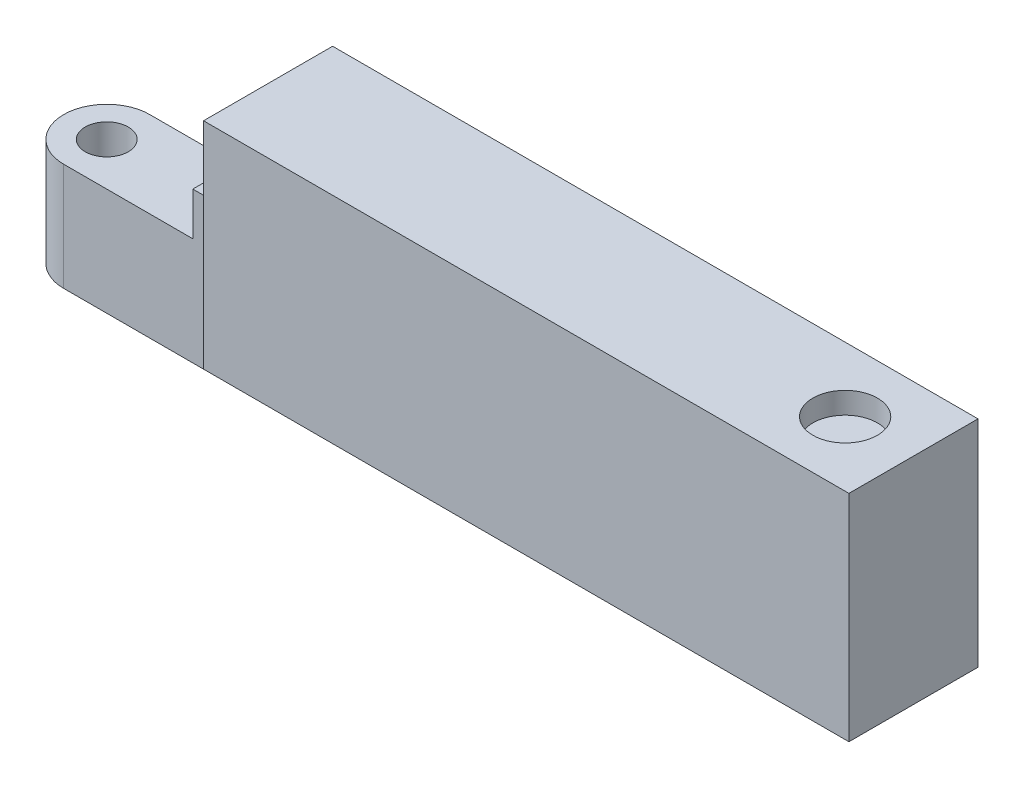
ISO-10303-21;
HEADER;
FILE_DESCRIPTION(('STEP AP214'),'2;1');
FILE_NAME('part.step','',(''),(''),'','','');
FILE_SCHEMA(('AUTOMOTIVE_DESIGN { 1 0 10303 214 1 1 1 1 }'));
ENDSEC;
DATA;
#1=APPLICATION_CONTEXT('core data for automotive mechanical design processes');
#2=APPLICATION_PROTOCOL_DEFINITION('international standard','automotive_design',2000,#1);
#3=PRODUCT_CONTEXT('',#1,'mechanical');
#4=PRODUCT('Part','Part','',(#3));
#5=PRODUCT_RELATED_PRODUCT_CATEGORY('part','',(#4));
#6=PRODUCT_DEFINITION_FORMATION('','',#4);
#7=PRODUCT_DEFINITION_CONTEXT('part definition',#1,'design');
#8=PRODUCT_DEFINITION('design','',#6,#7);
#9=PRODUCT_DEFINITION_SHAPE('','',#8);
#10=(LENGTH_UNIT() NAMED_UNIT(*) SI_UNIT(.MILLI.,.METRE.));
#11=(NAMED_UNIT(*) PLANE_ANGLE_UNIT() SI_UNIT($,.RADIAN.));
#12=(NAMED_UNIT(*) SI_UNIT($,.STERADIAN.) SOLID_ANGLE_UNIT());
#13=UNCERTAINTY_MEASURE_WITH_UNIT(LENGTH_MEASURE(1.E-05),#10,'distance_accuracy_value','');
#14=(GEOMETRIC_REPRESENTATION_CONTEXT(3) GLOBAL_UNCERTAINTY_ASSIGNED_CONTEXT((#13)) GLOBAL_UNIT_ASSIGNED_CONTEXT((#10,
#11,#12)) REPRESENTATION_CONTEXT('',''));
#15=CARTESIAN_POINT('',(0.,0.,0.));
#16=DIRECTION('',(0.,0.,1.));
#17=DIRECTION('',(1.,0.,0.));
#18=AXIS2_PLACEMENT_3D('',#15,#16,#17);
#19=CARTESIAN_POINT('',(-75.,-110.,-30.));
#20=DIRECTION('',(0.,-1.,0.));
#21=DIRECTION('',(1.,0.,0.));
#22=AXIS2_PLACEMENT_3D('',#19,#20,#21);
#23=CYLINDRICAL_SURFACE('',#22,20.);
#24=DIRECTION('',(0.,1.,0.));
#25=VECTOR('',#24,1.);
#26=CARTESIAN_POINT('',(-75.,-110.,-50.));
#27=LINE('',#26,#25);
#28=CARTESIAN_POINT('',(-75.,-110.,-50.));
#29=VERTEX_POINT('',#28);
#30=CARTESIAN_POINT('',(-75.,-60.,-50.));
#31=VERTEX_POINT('',#30);
#32=EDGE_CURVE('E232',#29,#31,#27,.T.);
#33=ORIENTED_EDGE('',*,*,#32,.F.);
#34=CARTESIAN_POINT('',(-75.,-110.,-30.));
#35=DIRECTION('',(0.,1.,0.));
#36=DIRECTION('',(-1.,0.,0.));
#37=AXIS2_PLACEMENT_3D('',#34,#35,#36);
#38=CIRCLE('',#37,20.);
#39=CARTESIAN_POINT('',(-75.,-110.,-9.99999999999999));
#40=VERTEX_POINT('',#39);
#41=EDGE_CURVE('E51',#40,#29,#38,.F.);
#42=ORIENTED_EDGE('',*,*,#41,.F.);
#43=DIRECTION('',(0.,1.,0.));
#44=VECTOR('',#43,1.);
#45=CARTESIAN_POINT('',(-75.,-110.,-9.99999999999999));
#46=LINE('',#45,#44);
#47=CARTESIAN_POINT('',(-75.,-60.,-10.));
#48=VERTEX_POINT('',#47);
#49=EDGE_CURVE('E236',#48,#40,#46,.F.);
#50=ORIENTED_EDGE('',*,*,#49,.F.);
#51=CARTESIAN_POINT('',(-75.,-60.,-30.));
#52=DIRECTION('',(0.,-1.,0.));
#53=DIRECTION('',(0.,0.,-1.));
#54=AXIS2_PLACEMENT_3D('',#51,#52,#53);
#55=CIRCLE('',#54,20.);
#56=EDGE_CURVE('E11',#31,#48,#55,.F.);
#57=ORIENTED_EDGE('',*,*,#56,.F.);
#58=EDGE_LOOP('',(#33,#42,#50,#57));
#59=FACE_BOUND('',#58,.T.);
#60=ADVANCED_FACE('F42',(#59),#23,.T.);
#61=CARTESIAN_POINT('',(0.,0.,-60.));
#62=DIRECTION('',(-1.,0.,0.));
#63=DIRECTION('',(0.,-1.,0.));
#64=AXIS2_PLACEMENT_3D('',#61,#62,#63);
#65=PLANE('',#64);
#66=DIRECTION('',(0.,-1.,0.));
#67=VECTOR('',#66,1.);
#68=CARTESIAN_POINT('',(0.,-40.,-50.));
#69=LINE('',#68,#67);
#70=CARTESIAN_POINT('',(0.,-40.,-50.));
#71=VERTEX_POINT('',#70);
#72=CARTESIAN_POINT('',(0.,-100.,-50.));
#73=VERTEX_POINT('',#72);
#74=EDGE_CURVE('E159',#71,#73,#69,.T.);
#75=ORIENTED_EDGE('',*,*,#74,.F.);
#76=DIRECTION('',(0.,0.,-1.));
#77=VECTOR('',#76,1.);
#78=CARTESIAN_POINT('',(0.,-40.,-50.));
#79=LINE('',#78,#77);
#80=CARTESIAN_POINT('',(0.,-40.,-10.));
#81=VERTEX_POINT('',#80);
#82=EDGE_CURVE('E171',#81,#71,#79,.T.);
#83=ORIENTED_EDGE('',*,*,#82,.F.);
#84=DIRECTION('',(0.,1.,0.));
#85=VECTOR('',#84,1.);
#86=CARTESIAN_POINT('',(0.,-40.,-10.));
#87=LINE('',#86,#85);
#88=CARTESIAN_POINT('',(0.,-100.,-9.99999999999999));
#89=VERTEX_POINT('',#88);
#90=EDGE_CURVE('E172',#89,#81,#87,.T.);
#91=ORIENTED_EDGE('',*,*,#90,.F.);
#92=DIRECTION('',(0.,0.,1.));
#93=VECTOR('',#92,1.);
#94=CARTESIAN_POINT('',(0.,-100.,-60.));
#95=LINE('',#94,#93);
#96=CARTESIAN_POINT('',(0.,-100.,0.));
#97=VERTEX_POINT('',#96);
#98=EDGE_CURVE('E203',#89,#97,#95,.T.);
#99=ORIENTED_EDGE('',*,*,#98,.T.);
#100=DIRECTION('',(0.,-1.,0.));
#101=VECTOR('',#100,1.);
#102=CARTESIAN_POINT('',(0.,0.,0.));
#103=LINE('',#102,#101);
#104=CARTESIAN_POINT('',(0.,0.,0.));
#105=VERTEX_POINT('',#104);
#106=EDGE_CURVE('E185',#105,#97,#103,.T.);
#107=ORIENTED_EDGE('',*,*,#106,.F.);
#108=DIRECTION('',(0.,0.,1.));
#109=VECTOR('',#108,1.);
#110=CARTESIAN_POINT('',(0.,0.,-60.));
#111=LINE('',#110,#109);
#112=CARTESIAN_POINT('',(0.,0.,-60.));
#113=VERTEX_POINT('',#112);
#114=EDGE_CURVE('E218',#113,#105,#111,.T.);
#115=ORIENTED_EDGE('',*,*,#114,.F.);
#116=DIRECTION('',(0.,-1.,0.));
#117=VECTOR('',#116,1.);
#118=CARTESIAN_POINT('',(0.,0.,-60.));
#119=LINE('',#118,#117);
#120=CARTESIAN_POINT('',(0.,-100.,-60.));
#121=VERTEX_POINT('',#120);
#122=EDGE_CURVE('E186',#113,#121,#119,.T.);
#123=ORIENTED_EDGE('',*,*,#122,.T.);
#124=EDGE_CURVE('E227',#121,#73,#95,.T.);
#125=ORIENTED_EDGE('',*,*,#124,.T.);
#126=EDGE_LOOP('',(#75,#83,#91,#99,#107,#115,#123,#125));
#127=FACE_BOUND('',#126,.T.);
#128=ADVANCED_FACE('F282',(#127),#65,.T.);
#129=CARTESIAN_POINT('',(0.,0.,-60.));
#130=DIRECTION('',(0.,1.,0.));
#131=DIRECTION('',(0.,0.,1.));
#132=AXIS2_PLACEMENT_3D('',#129,#130,#131);
#133=PLANE('',#132);
#134=CARTESIAN_POINT('',(268.245164070437,0.,-30.));
#135=DIRECTION('',(0.,1.,0.));
#136=DIRECTION('',(0.,0.,1.));
#137=AXIS2_PLACEMENT_3D('',#134,#135,#136);
#138=CIRCLE('',#137,15.);
#139=CARTESIAN_POINT('',(268.245164070437,0.,-15.));
#140=VERTEX_POINT('',#139);
#141=EDGE_CURVE('E269',#140,#140,#138,.T.);
#142=ORIENTED_EDGE('',*,*,#141,.F.);
#143=EDGE_LOOP('',(#142));
#144=FACE_BOUND('',#143,.T.);
#145=DIRECTION('',(-1.,0.,0.));
#146=VECTOR('',#145,1.);
#147=CARTESIAN_POINT('',(0.,0.,0.));
#148=LINE('',#147,#146);
#149=CARTESIAN_POINT('',(300.,0.,0.));
#150=VERTEX_POINT('',#149);
#151=EDGE_CURVE('E191',#150,#105,#148,.T.);
#152=ORIENTED_EDGE('',*,*,#151,.F.);
#153=DIRECTION('',(0.,0.,1.));
#154=VECTOR('',#153,1.);
#155=CARTESIAN_POINT('',(300.,0.,-60.));
#156=LINE('',#155,#154);
#157=CARTESIAN_POINT('',(300.,0.,-60.));
#158=VERTEX_POINT('',#157);
#159=EDGE_CURVE('E221',#158,#150,#156,.T.);
#160=ORIENTED_EDGE('',*,*,#159,.F.);
#161=DIRECTION('',(-1.,0.,0.));
#162=VECTOR('',#161,1.);
#163=CARTESIAN_POINT('',(0.,0.,-60.));
#164=LINE('',#163,#162);
#165=EDGE_CURVE('E199',#158,#113,#164,.T.);
#166=ORIENTED_EDGE('',*,*,#165,.T.);
#167=ORIENTED_EDGE('',*,*,#114,.T.);
#168=EDGE_LOOP('',(#152,#160,#166,#167));
#169=FACE_BOUND('',#168,.T.);
#170=ADVANCED_FACE('F278',(#144,#169),#133,.T.);
#171=CARTESIAN_POINT('',(300.,0.,-60.));
#172=DIRECTION('',(1.,0.,0.));
#173=DIRECTION('',(0.,0.,-1.));
#174=AXIS2_PLACEMENT_3D('',#171,#172,#173);
#175=PLANE('',#174);
#176=DIRECTION('',(0.,1.,0.));
#177=VECTOR('',#176,1.);
#178=CARTESIAN_POINT('',(300.,0.,0.));
#179=LINE('',#178,#177);
#180=CARTESIAN_POINT('',(300.,-100.,0.));
#181=VERTEX_POINT('',#180);
#182=EDGE_CURVE('E211',#181,#150,#179,.T.);
#183=ORIENTED_EDGE('',*,*,#182,.F.);
#184=DIRECTION('',(0.,0.,1.));
#185=VECTOR('',#184,1.);
#186=CARTESIAN_POINT('',(300.,-100.,-60.));
#187=LINE('',#186,#185);
#188=CARTESIAN_POINT('',(300.,-100.,-60.));
#189=VERTEX_POINT('',#188);
#190=EDGE_CURVE('E224',#189,#181,#187,.T.);
#191=ORIENTED_EDGE('',*,*,#190,.F.);
#192=DIRECTION('',(0.,1.,0.));
#193=VECTOR('',#192,1.);
#194=CARTESIAN_POINT('',(300.,0.,-60.));
#195=LINE('',#194,#193);
#196=EDGE_CURVE('E195',#189,#158,#195,.T.);
#197=ORIENTED_EDGE('',*,*,#196,.T.);
#198=ORIENTED_EDGE('',*,*,#159,.T.);
#199=EDGE_LOOP('',(#183,#191,#197,#198));
#200=FACE_BOUND('',#199,.T.);
#201=ADVANCED_FACE('F281',(#200),#175,.T.);
#202=CARTESIAN_POINT('',(0.,-100.,-60.));
#203=DIRECTION('',(0.,-1.,0.));
#204=DIRECTION('',(0.,0.,-1.));
#205=AXIS2_PLACEMENT_3D('',#202,#203,#204);
#206=PLANE('',#205);
#207=DIRECTION('',(1.,0.,0.));
#208=VECTOR('',#207,1.);
#209=CARTESIAN_POINT('',(0.,-100.,0.));
#210=LINE('',#209,#208);
#211=EDGE_CURVE('E207',#97,#181,#210,.T.);
#212=ORIENTED_EDGE('',*,*,#211,.F.);
#213=ORIENTED_EDGE('',*,*,#98,.F.);
#214=EDGE_CURVE('E231',#73,#89,#95,.T.);
#215=ORIENTED_EDGE('',*,*,#214,.F.);
#216=ORIENTED_EDGE('',*,*,#124,.F.);
#217=DIRECTION('',(1.,0.,0.));
#218=VECTOR('',#217,1.);
#219=CARTESIAN_POINT('',(0.,-100.,-60.));
#220=LINE('',#219,#218);
#221=EDGE_CURVE('E190',#121,#189,#220,.T.);
#222=ORIENTED_EDGE('',*,*,#221,.T.);
#223=ORIENTED_EDGE('',*,*,#190,.T.);
#224=EDGE_LOOP('',(#212,#213,#215,#216,#222,#223));
#225=FACE_BOUND('',#224,.T.);
#226=ADVANCED_FACE('F299',(#225),#206,.T.);
#227=CARTESIAN_POINT('',(0.,0.,-60.));
#228=DIRECTION('',(0.,0.,1.));
#229=DIRECTION('',(1.,0.,0.));
#230=AXIS2_PLACEMENT_3D('',#227,#228,#229);
#231=PLANE('',#230);
#232=ORIENTED_EDGE('',*,*,#122,.F.);
#233=ORIENTED_EDGE('',*,*,#165,.F.);
#234=ORIENTED_EDGE('',*,*,#196,.F.);
#235=ORIENTED_EDGE('',*,*,#221,.F.);
#236=EDGE_LOOP('',(#232,#233,#234,#235));
#237=FACE_BOUND('',#236,.T.);
#238=ADVANCED_FACE('F296',(#237),#231,.F.);
#239=CARTESIAN_POINT('',(0.,0.,0.));
#240=DIRECTION('',(0.,0.,1.));
#241=DIRECTION('',(1.,0.,0.));
#242=AXIS2_PLACEMENT_3D('',#239,#240,#241);
#243=PLANE('',#242);
#244=ORIENTED_EDGE('',*,*,#106,.T.);
#245=ORIENTED_EDGE('',*,*,#211,.T.);
#246=ORIENTED_EDGE('',*,*,#182,.T.);
#247=ORIENTED_EDGE('',*,*,#151,.T.);
#248=EDGE_LOOP('',(#244,#245,#246,#247));
#249=FACE_BOUND('',#248,.T.);
#250=ADVANCED_FACE('F287',(#249),#243,.T.);
#251=CARTESIAN_POINT('',(0.,0.,0.));
#252=DIRECTION('',(-1.,0.,0.));
#253=DIRECTION('',(0.,-1.,0.));
#254=AXIS2_PLACEMENT_3D('',#251,#252,#253);
#255=PLANE('',#254);
#256=CARTESIAN_POINT('',(0.,-110.,-50.));
#257=VERTEX_POINT('',#256);
#258=EDGE_CURVE('E158',#73,#257,#69,.T.);
#259=ORIENTED_EDGE('',*,*,#258,.F.);
#260=ORIENTED_EDGE('',*,*,#214,.T.);
#261=CARTESIAN_POINT('',(0.,-110.,-9.99999999999999));
#262=VERTEX_POINT('',#261);
#263=EDGE_CURVE('E167',#262,#89,#87,.T.);
#264=ORIENTED_EDGE('',*,*,#263,.F.);
#265=DIRECTION('',(0.,0.,1.));
#266=VECTOR('',#265,1.);
#267=CARTESIAN_POINT('',(0.,-110.,-50.));
#268=LINE('',#267,#266);
#269=EDGE_CURVE('E163',#257,#262,#268,.T.);
#270=ORIENTED_EDGE('',*,*,#269,.F.);
#271=EDGE_LOOP('',(#259,#260,#264,#270));
#272=FACE_BOUND('',#271,.T.);
#273=ADVANCED_FACE('F253',(#272),#255,.F.);
#274=CARTESIAN_POINT('',(-95.,-40.,-50.));
#275=DIRECTION('',(0.,0.,1.));
#276=DIRECTION('',(0.,-1.,0.));
#277=AXIS2_PLACEMENT_3D('',#274,#275,#276);
#278=PLANE('',#277);
#279=DIRECTION('',(1.,0.,0.));
#280=VECTOR('',#279,1.);
#281=CARTESIAN_POINT('',(-95.,-110.,-50.));
#282=LINE('',#281,#280);
#283=EDGE_CURVE('E182',#29,#257,#282,.T.);
#284=ORIENTED_EDGE('',*,*,#283,.F.);
#285=ORIENTED_EDGE('',*,*,#32,.T.);
#286=DIRECTION('',(1.,0.,0.));
#287=VECTOR('',#286,1.);
#288=CARTESIAN_POINT('',(-95.,-60.,-50.));
#289=LINE('',#288,#287);
#290=CARTESIAN_POINT('',(-15.,-60.,-50.));
#291=VERTEX_POINT('',#290);
#292=EDGE_CURVE('E152',#31,#291,#289,.T.);
#293=ORIENTED_EDGE('',*,*,#292,.T.);
#294=DIRECTION('',(0.,1.,0.));
#295=VECTOR('',#294,1.);
#296=CARTESIAN_POINT('',(-15.,-40.,-50.));
#297=LINE('',#296,#295);
#298=CARTESIAN_POINT('',(-15.,-40.,-50.));
#299=VERTEX_POINT('',#298);
#300=EDGE_CURVE('E137',#291,#299,#297,.T.);
#301=ORIENTED_EDGE('',*,*,#300,.T.);
#302=DIRECTION('',(1.,0.,0.));
#303=VECTOR('',#302,1.);
#304=CARTESIAN_POINT('',(-95.,-40.,-50.));
#305=LINE('',#304,#303);
#306=EDGE_CURVE('E175',#299,#71,#305,.T.);
#307=ORIENTED_EDGE('',*,*,#306,.T.);
#308=ORIENTED_EDGE('',*,*,#74,.T.);
#309=ORIENTED_EDGE('',*,*,#258,.T.);
#310=EDGE_LOOP('',(#284,#285,#293,#301,#307,#308,#309));
#311=FACE_BOUND('',#310,.T.);
#312=ADVANCED_FACE('F245',(#311),#278,.F.);
#313=CARTESIAN_POINT('',(-95.,-110.,-50.));
#314=DIRECTION('',(0.,1.,0.));
#315=DIRECTION('',(-1.,0.,0.));
#316=AXIS2_PLACEMENT_3D('',#313,#314,#315);
#317=PLANE('',#316);
#318=CARTESIAN_POINT('',(-75.,-110.,-30.));
#319=DIRECTION('',(0.,1.,0.));
#320=DIRECTION('',(0.,0.,1.));
#321=AXIS2_PLACEMENT_3D('',#318,#319,#320);
#322=CIRCLE('',#321,9.99999999999999);
#323=CARTESIAN_POINT('',(-75.,-110.,-20.));
#324=VERTEX_POINT('',#323);
#325=EDGE_CURVE('E130',#324,#324,#322,.T.);
#326=ORIENTED_EDGE('',*,*,#325,.T.);
#327=EDGE_LOOP('',(#326));
#328=FACE_BOUND('',#327,.T.);
#329=DIRECTION('',(1.,0.,0.));
#330=VECTOR('',#329,1.);
#331=CARTESIAN_POINT('',(-95.,-110.,-9.99999999999999));
#332=LINE('',#331,#330);
#333=EDGE_CURVE('E179',#40,#262,#332,.T.);
#334=ORIENTED_EDGE('',*,*,#333,.F.);
#335=ORIENTED_EDGE('',*,*,#41,.T.);
#336=ORIENTED_EDGE('',*,*,#283,.T.);
#337=ORIENTED_EDGE('',*,*,#269,.T.);
#338=EDGE_LOOP('',(#334,#335,#336,#337));
#339=FACE_BOUND('',#338,.T.);
#340=ADVANCED_FACE('F241',(#328,#339),#317,.F.);
#341=CARTESIAN_POINT('',(-95.,-40.,-10.));
#342=DIRECTION('',(0.,0.,-1.));
#343=DIRECTION('',(0.,1.,0.));
#344=AXIS2_PLACEMENT_3D('',#341,#342,#343);
#345=PLANE('',#344);
#346=DIRECTION('',(1.,0.,0.));
#347=VECTOR('',#346,1.);
#348=CARTESIAN_POINT('',(-95.,-60.,-10.));
#349=LINE('',#348,#347);
#350=CARTESIAN_POINT('',(-15.,-60.,-10.));
#351=VERTEX_POINT('',#350);
#352=EDGE_CURVE('E122',#48,#351,#349,.T.);
#353=ORIENTED_EDGE('',*,*,#352,.F.);
#354=ORIENTED_EDGE('',*,*,#49,.T.);
#355=ORIENTED_EDGE('',*,*,#333,.T.);
#356=ORIENTED_EDGE('',*,*,#263,.T.);
#357=ORIENTED_EDGE('',*,*,#90,.T.);
#358=DIRECTION('',(1.,0.,0.));
#359=VECTOR('',#358,1.);
#360=CARTESIAN_POINT('',(-95.,-40.,-10.));
#361=LINE('',#360,#359);
#362=CARTESIAN_POINT('',(-15.,-40.,-10.));
#363=VERTEX_POINT('',#362);
#364=EDGE_CURVE('E144',#363,#81,#361,.T.);
#365=ORIENTED_EDGE('',*,*,#364,.F.);
#366=DIRECTION('',(0.,1.,0.));
#367=VECTOR('',#366,1.);
#368=CARTESIAN_POINT('',(-15.,-40.,-10.));
#369=LINE('',#368,#367);
#370=EDGE_CURVE('E129',#351,#363,#369,.T.);
#371=ORIENTED_EDGE('',*,*,#370,.F.);
#372=EDGE_LOOP('',(#353,#354,#355,#356,#357,#365,#371));
#373=FACE_BOUND('',#372,.T.);
#374=ADVANCED_FACE('F142',(#373),#345,.F.);
#375=CARTESIAN_POINT('',(-95.,-40.,-50.));
#376=DIRECTION('',(0.,-1.,0.));
#377=DIRECTION('',(1.,0.,0.));
#378=AXIS2_PLACEMENT_3D('',#375,#376,#377);
#379=PLANE('',#378);
#380=ORIENTED_EDGE('',*,*,#306,.F.);
#381=DIRECTION('',(0.,0.,1.));
#382=VECTOR('',#381,1.);
#383=CARTESIAN_POINT('',(-15.,-40.,-60.));
#384=LINE('',#383,#382);
#385=EDGE_CURVE('E139',#299,#363,#384,.T.);
#386=ORIENTED_EDGE('',*,*,#385,.T.);
#387=ORIENTED_EDGE('',*,*,#364,.T.);
#388=ORIENTED_EDGE('',*,*,#82,.T.);
#389=EDGE_LOOP('',(#380,#386,#387,#388));
#390=FACE_BOUND('',#389,.T.);
#391=ADVANCED_FACE('F368',(#390),#379,.F.);
#392=CARTESIAN_POINT('',(-15.,-40.,-60.));
#393=DIRECTION('',(1.,0.,0.));
#394=DIRECTION('',(0.,0.,-1.));
#395=AXIS2_PLACEMENT_3D('',#392,#393,#394);
#396=PLANE('',#395);
#397=DIRECTION('',(0.,0.,1.));
#398=VECTOR('',#397,1.);
#399=CARTESIAN_POINT('',(-15.,-60.,-60.));
#400=LINE('',#399,#398);
#401=EDGE_CURVE('E125',#291,#351,#400,.T.);
#402=ORIENTED_EDGE('',*,*,#401,.T.);
#403=ORIENTED_EDGE('',*,*,#370,.T.);
#404=ORIENTED_EDGE('',*,*,#385,.F.);
#405=ORIENTED_EDGE('',*,*,#300,.F.);
#406=EDGE_LOOP('',(#402,#403,#404,#405));
#407=FACE_BOUND('',#406,.T.);
#408=ADVANCED_FACE('F134',(#407),#396,.F.);
#409=CARTESIAN_POINT('',(-95.,-60.,-60.));
#410=DIRECTION('',(0.,-1.,0.));
#411=DIRECTION('',(0.,0.,-1.));
#412=AXIS2_PLACEMENT_3D('',#409,#410,#411);
#413=PLANE('',#412);
#414=CARTESIAN_POINT('',(-75.,-60.,-30.));
#415=DIRECTION('',(0.,1.,0.));
#416=DIRECTION('',(0.,0.,1.));
#417=AXIS2_PLACEMENT_3D('',#414,#415,#416);
#418=CIRCLE('',#417,9.99999999999999);
#419=CARTESIAN_POINT('',(-75.,-60.,-20.));
#420=VERTEX_POINT('',#419);
#421=EDGE_CURVE('E260',#420,#420,#418,.T.);
#422=ORIENTED_EDGE('',*,*,#421,.F.);
#423=EDGE_LOOP('',(#422));
#424=FACE_BOUND('',#423,.T.);
#425=ORIENTED_EDGE('',*,*,#292,.F.);
#426=ORIENTED_EDGE('',*,*,#56,.T.);
#427=ORIENTED_EDGE('',*,*,#352,.T.);
#428=ORIENTED_EDGE('',*,*,#401,.F.);
#429=EDGE_LOOP('',(#425,#426,#427,#428));
#430=FACE_BOUND('',#429,.T.);
#431=ADVANCED_FACE('F124',(#424,#430),#413,.F.);
#432=CARTESIAN_POINT('',(-75.,-110.,-30.));
#433=DIRECTION('',(0.,1.,0.));
#434=DIRECTION('',(0.,0.,1.));
#435=AXIS2_PLACEMENT_3D('',#432,#433,#434);
#436=CYLINDRICAL_SURFACE('',#435,9.99999999999999);
#437=ORIENTED_EDGE('',*,*,#325,.F.);
#438=EDGE_LOOP('',(#437));
#439=FACE_BOUND('',#438,.T.);
#440=ORIENTED_EDGE('',*,*,#421,.T.);
#441=EDGE_LOOP('',(#440));
#442=FACE_BOUND('',#441,.T.);
#443=ADVANCED_FACE('F389',(#439,#442),#436,.F.);
#444=CARTESIAN_POINT('',(268.245164070437,-10.,-30.));
#445=DIRECTION('',(0.,1.,0.));
#446=DIRECTION('',(0.,0.,1.));
#447=AXIS2_PLACEMENT_3D('',#444,#445,#446);
#448=CYLINDRICAL_SURFACE('',#447,15.);
#449=CARTESIAN_POINT('',(268.245164070437,-10.,-30.));
#450=DIRECTION('',(0.,1.,0.));
#451=DIRECTION('',(0.,0.,1.));
#452=AXIS2_PLACEMENT_3D('',#449,#450,#451);
#453=CIRCLE('',#452,15.);
#454=CARTESIAN_POINT('',(268.245164070437,-10.,-15.));
#455=VERTEX_POINT('',#454);
#456=EDGE_CURVE('E264',#455,#455,#453,.T.);
#457=ORIENTED_EDGE('',*,*,#456,.F.);
#458=EDGE_LOOP('',(#457));
#459=FACE_BOUND('',#458,.T.);
#460=ORIENTED_EDGE('',*,*,#141,.T.);
#461=EDGE_LOOP('',(#460));
#462=FACE_BOUND('',#461,.T.);
#463=ADVANCED_FACE('F276',(#459,#462),#448,.F.);
#464=CARTESIAN_POINT('',(268.245164070437,-10.,-30.));
#465=DIRECTION('',(0.,1.,0.));
#466=DIRECTION('',(0.,0.,1.));
#467=AXIS2_PLACEMENT_3D('',#464,#465,#466);
#468=PLANE('',#467);
#469=ORIENTED_EDGE('',*,*,#456,.T.);
#470=EDGE_LOOP('',(#469));
#471=FACE_BOUND('',#470,.T.);
#472=ADVANCED_FACE('F406',(#471),#468,.T.);
#473=CLOSED_SHELL('',(#60,#128,#170,#201,#226,#238,#250,#273,#312,#340,#374,#391,#408,#431,#443,
#463,#472));
#474=MANIFOLD_SOLID_BREP('B2',#473);
#475=ADVANCED_BREP_SHAPE_REPRESENTATION('',(#18,#474),#14);
#476=SHAPE_DEFINITION_REPRESENTATION(#9,#475);
ENDSEC;
END-ISO-10303-21;
